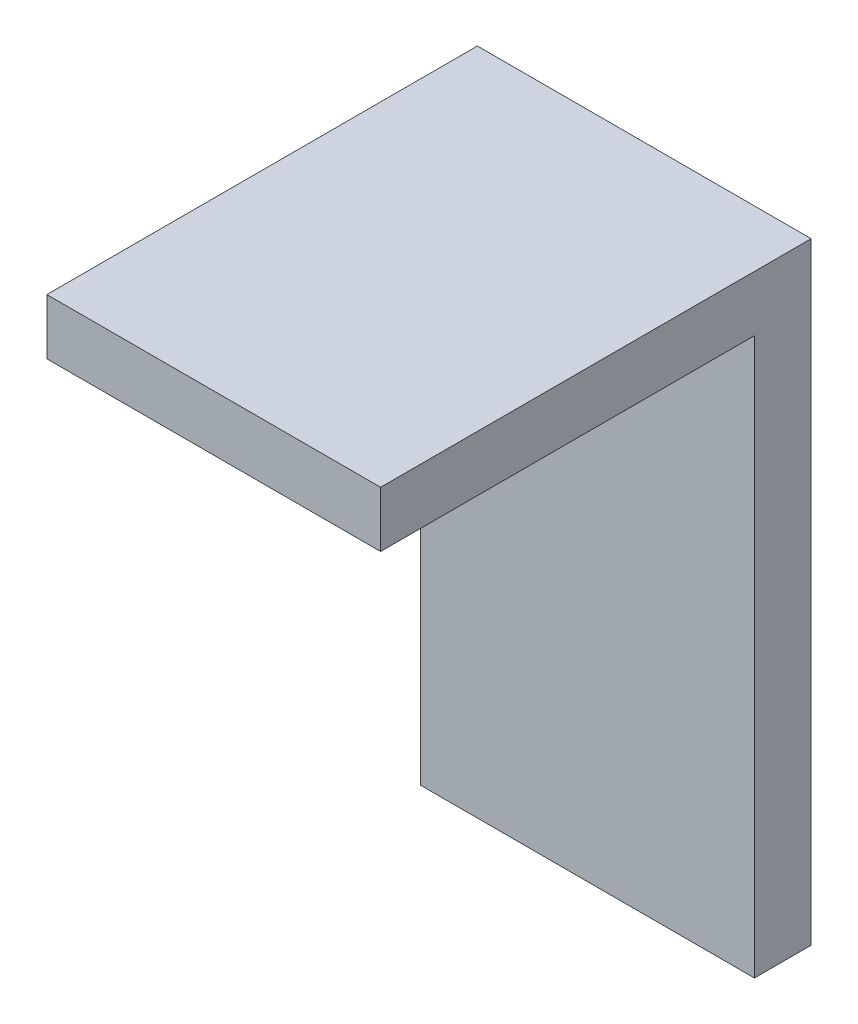
ISO-10303-21;
HEADER;
FILE_DESCRIPTION(('STEP AP214'),'2;1');
FILE_NAME('part.step','',(''),(''),'','','');
FILE_SCHEMA(('AUTOMOTIVE_DESIGN { 1 0 10303 214 1 1 1 1 }'));
ENDSEC;
DATA;
#1=APPLICATION_CONTEXT('core data for automotive mechanical design processes');
#2=APPLICATION_PROTOCOL_DEFINITION('international standard','automotive_design',2000,#1);
#3=PRODUCT_CONTEXT('',#1,'mechanical');
#4=PRODUCT('Part','Part','',(#3));
#5=PRODUCT_RELATED_PRODUCT_CATEGORY('part','',(#4));
#6=PRODUCT_DEFINITION_FORMATION('','',#4);
#7=PRODUCT_DEFINITION_CONTEXT('part definition',#1,'design');
#8=PRODUCT_DEFINITION('design','',#6,#7);
#9=PRODUCT_DEFINITION_SHAPE('','',#8);
#10=(LENGTH_UNIT() NAMED_UNIT(*) SI_UNIT(.MILLI.,.METRE.));
#11=(NAMED_UNIT(*) PLANE_ANGLE_UNIT() SI_UNIT($,.RADIAN.));
#12=(NAMED_UNIT(*) SI_UNIT($,.STERADIAN.) SOLID_ANGLE_UNIT());
#13=UNCERTAINTY_MEASURE_WITH_UNIT(LENGTH_MEASURE(1.E-05),#10,'distance_accuracy_value','');
#14=(GEOMETRIC_REPRESENTATION_CONTEXT(3) GLOBAL_UNCERTAINTY_ASSIGNED_CONTEXT((#13)) GLOBAL_UNIT_ASSIGNED_CONTEXT((#10,
#11,#12)) REPRESENTATION_CONTEXT('',''));
#15=CARTESIAN_POINT('',(0.,0.,0.));
#16=DIRECTION('',(0.,0.,1.));
#17=DIRECTION('',(1.,0.,0.));
#18=AXIS2_PLACEMENT_3D('',#15,#16,#17);
#19=CARTESIAN_POINT('',(1.1,4.55,0.));
#20=DIRECTION('',(-1.,0.,0.));
#21=DIRECTION('',(0.,0.,1.));
#22=AXIS2_PLACEMENT_3D('',#19,#20,#21);
#23=PLANE('',#22);
#24=DIRECTION('',(0.,1.,0.));
#25=VECTOR('',#24,1.);
#26=CARTESIAN_POINT('',(1.1,4.,0.));
#27=LINE('',#26,#25);
#28=CARTESIAN_POINT('',(1.1,4.,0.));
#29=VERTEX_POINT('',#28);
#30=CARTESIAN_POINT('',(1.1,4.55,0.));
#31=VERTEX_POINT('',#30);
#32=EDGE_CURVE('E11',#29,#31,#27,.T.);
#33=ORIENTED_EDGE('',*,*,#32,.F.);
#34=DIRECTION('',(0.,0.,-1.));
#35=VECTOR('',#34,1.);
#36=CARTESIAN_POINT('',(1.1,4.,0.051));
#37=LINE('',#36,#35);
#38=CARTESIAN_POINT('',(1.1,4.,0.051));
#39=VERTEX_POINT('',#38);
#40=EDGE_CURVE('E24',#39,#29,#37,.T.);
#41=ORIENTED_EDGE('',*,*,#40,.F.);
#42=DIRECTION('',(0.,-1.,0.));
#43=VECTOR('',#42,1.);
#44=CARTESIAN_POINT('',(1.1,4.5,0.051));
#45=LINE('',#44,#43);
#46=CARTESIAN_POINT('',(1.1,4.5,0.051));
#47=VERTEX_POINT('',#46);
#48=EDGE_CURVE('E87',#47,#39,#45,.T.);
#49=ORIENTED_EDGE('',*,*,#48,.F.);
#50=DIRECTION('',(0.,0.,-1.));
#51=VECTOR('',#50,1.);
#52=CARTESIAN_POINT('',(1.1,4.5,0.387));
#53=LINE('',#52,#51);
#54=CARTESIAN_POINT('',(1.1,4.5,0.387));
#55=VERTEX_POINT('',#54);
#56=EDGE_CURVE('E114',#55,#47,#53,.T.);
#57=ORIENTED_EDGE('',*,*,#56,.F.);
#58=DIRECTION('',(0.,-1.,0.));
#59=VECTOR('',#58,1.);
#60=CARTESIAN_POINT('',(1.1,4.55,0.387));
#61=LINE('',#60,#59);
#62=CARTESIAN_POINT('',(1.1,4.55,0.387));
#63=VERTEX_POINT('',#62);
#64=EDGE_CURVE('E111',#63,#55,#61,.T.);
#65=ORIENTED_EDGE('',*,*,#64,.F.);
#66=DIRECTION('',(0.,0.,1.));
#67=VECTOR('',#66,1.);
#68=CARTESIAN_POINT('',(1.1,4.55,0.));
#69=LINE('',#68,#67);
#70=EDGE_CURVE('E108',#31,#63,#69,.T.);
#71=ORIENTED_EDGE('',*,*,#70,.F.);
#72=EDGE_LOOP('',(#33,#41,#49,#57,#65,#71));
#73=FACE_BOUND('',#72,.T.);
#74=ADVANCED_FACE('F17',(#73),#23,.T.);
#75=CARTESIAN_POINT('',(1.4,4.,0.));
#76=DIRECTION('',(1.,0.,0.));
#77=DIRECTION('',(0.,0.,1.));
#78=AXIS2_PLACEMENT_3D('',#75,#76,#77);
#79=PLANE('',#78);
#80=DIRECTION('',(0.,-1.,0.));
#81=VECTOR('',#80,1.);
#82=CARTESIAN_POINT('',(1.4,4.55,0.));
#83=LINE('',#82,#81);
#84=CARTESIAN_POINT('',(1.4,4.55,0.));
#85=VERTEX_POINT('',#84);
#86=CARTESIAN_POINT('',(1.4,4.,0.));
#87=VERTEX_POINT('',#86);
#88=EDGE_CURVE('E106',#85,#87,#83,.T.);
#89=ORIENTED_EDGE('',*,*,#88,.F.);
#90=DIRECTION('',(0.,0.,-1.));
#91=VECTOR('',#90,1.);
#92=CARTESIAN_POINT('',(1.4,4.55,0.387));
#93=LINE('',#92,#91);
#94=CARTESIAN_POINT('',(1.4,4.55,0.387));
#95=VERTEX_POINT('',#94);
#96=EDGE_CURVE('E103',#95,#85,#93,.T.);
#97=ORIENTED_EDGE('',*,*,#96,.F.);
#98=DIRECTION('',(0.,1.,0.));
#99=VECTOR('',#98,1.);
#100=CARTESIAN_POINT('',(1.4,4.5,0.387));
#101=LINE('',#100,#99);
#102=CARTESIAN_POINT('',(1.4,4.5,0.387));
#103=VERTEX_POINT('',#102);
#104=EDGE_CURVE('E100',#103,#95,#101,.T.);
#105=ORIENTED_EDGE('',*,*,#104,.F.);
#106=DIRECTION('',(0.,0.,1.));
#107=VECTOR('',#106,1.);
#108=CARTESIAN_POINT('',(1.4,4.5,0.051));
#109=LINE('',#108,#107);
#110=CARTESIAN_POINT('',(1.4,4.5,0.051));
#111=VERTEX_POINT('',#110);
#112=EDGE_CURVE('E72',#111,#103,#109,.T.);
#113=ORIENTED_EDGE('',*,*,#112,.F.);
#114=DIRECTION('',(0.,1.,0.));
#115=VECTOR('',#114,1.);
#116=CARTESIAN_POINT('',(1.4,4.,0.051));
#117=LINE('',#116,#115);
#118=CARTESIAN_POINT('',(1.4,4.,0.051));
#119=VERTEX_POINT('',#118);
#120=EDGE_CURVE('E66',#119,#111,#117,.T.);
#121=ORIENTED_EDGE('',*,*,#120,.F.);
#122=DIRECTION('',(0.,0.,1.));
#123=VECTOR('',#122,1.);
#124=CARTESIAN_POINT('',(1.4,4.,0.));
#125=LINE('',#124,#123);
#126=EDGE_CURVE('E69',#87,#119,#125,.T.);
#127=ORIENTED_EDGE('',*,*,#126,.F.);
#128=EDGE_LOOP('',(#89,#97,#105,#113,#121,#127));
#129=FACE_BOUND('',#128,.T.);
#130=ADVANCED_FACE('F68',(#129),#79,.T.);
#131=CARTESIAN_POINT('',(1.1,4.55,0.387));
#132=DIRECTION('',(0.,0.,1.));
#133=DIRECTION('',(0.,1.,0.));
#134=AXIS2_PLACEMENT_3D('',#131,#132,#133);
#135=PLANE('',#134);
#136=ORIENTED_EDGE('',*,*,#64,.T.);
#137=DIRECTION('',(-1.,0.,0.));
#138=VECTOR('',#137,1.);
#139=CARTESIAN_POINT('',(1.4,4.5,0.387));
#140=LINE('',#139,#138);
#141=EDGE_CURVE('E83',#103,#55,#140,.T.);
#142=ORIENTED_EDGE('',*,*,#141,.F.);
#143=ORIENTED_EDGE('',*,*,#104,.T.);
#144=DIRECTION('',(1.,0.,0.));
#145=VECTOR('',#144,1.);
#146=CARTESIAN_POINT('',(1.1,4.55,0.387));
#147=LINE('',#146,#145);
#148=EDGE_CURVE('E88',#63,#95,#147,.T.);
#149=ORIENTED_EDGE('',*,*,#148,.F.);
#150=EDGE_LOOP('',(#136,#142,#143,#149));
#151=FACE_BOUND('',#150,.T.);
#152=ADVANCED_FACE('F125',(#151),#135,.T.);
#153=CARTESIAN_POINT('',(1.1,4.5,0.051));
#154=DIRECTION('',(0.,0.,1.));
#155=DIRECTION('',(0.,1.,0.));
#156=AXIS2_PLACEMENT_3D('',#153,#154,#155);
#157=PLANE('',#156);
#158=ORIENTED_EDGE('',*,*,#48,.T.);
#159=DIRECTION('',(-1.,0.,0.));
#160=VECTOR('',#159,1.);
#161=CARTESIAN_POINT('',(1.4,4.,0.051));
#162=LINE('',#161,#160);
#163=EDGE_CURVE('E81',#119,#39,#162,.T.);
#164=ORIENTED_EDGE('',*,*,#163,.F.);
#165=ORIENTED_EDGE('',*,*,#120,.T.);
#166=DIRECTION('',(1.,0.,0.));
#167=VECTOR('',#166,1.);
#168=CARTESIAN_POINT('',(1.1,4.5,0.051));
#169=LINE('',#168,#167);
#170=EDGE_CURVE('E89',#47,#111,#169,.T.);
#171=ORIENTED_EDGE('',*,*,#170,.F.);
#172=EDGE_LOOP('',(#158,#164,#165,#171));
#173=FACE_BOUND('',#172,.T.);
#174=ADVANCED_FACE('F86',(#173),#157,.T.);
#175=CARTESIAN_POINT('',(1.4,4.55,0.));
#176=DIRECTION('',(0.,1.,0.));
#177=DIRECTION('',(0.,0.,1.));
#178=AXIS2_PLACEMENT_3D('',#175,#176,#177);
#179=PLANE('',#178);
#180=DIRECTION('',(1.,0.,0.));
#181=VECTOR('',#180,1.);
#182=CARTESIAN_POINT('',(1.1,4.55,0.));
#183=LINE('',#182,#181);
#184=EDGE_CURVE('E93',#31,#85,#183,.T.);
#185=ORIENTED_EDGE('',*,*,#184,.F.);
#186=ORIENTED_EDGE('',*,*,#70,.T.);
#187=ORIENTED_EDGE('',*,*,#148,.T.);
#188=ORIENTED_EDGE('',*,*,#96,.T.);
#189=EDGE_LOOP('',(#185,#186,#187,#188));
#190=FACE_BOUND('',#189,.T.);
#191=ADVANCED_FACE('F121',(#190),#179,.T.);
#192=CARTESIAN_POINT('',(1.1,4.,0.));
#193=DIRECTION('',(0.,-1.,0.));
#194=DIRECTION('',(0.,0.,1.));
#195=AXIS2_PLACEMENT_3D('',#192,#193,#194);
#196=PLANE('',#195);
#197=DIRECTION('',(-1.,0.,0.));
#198=VECTOR('',#197,1.);
#199=CARTESIAN_POINT('',(1.4,4.,0.));
#200=LINE('',#199,#198);
#201=EDGE_CURVE('E82',#87,#29,#200,.T.);
#202=ORIENTED_EDGE('',*,*,#201,.F.);
#203=ORIENTED_EDGE('',*,*,#126,.T.);
#204=ORIENTED_EDGE('',*,*,#163,.T.);
#205=ORIENTED_EDGE('',*,*,#40,.T.);
#206=EDGE_LOOP('',(#202,#203,#204,#205));
#207=FACE_BOUND('',#206,.T.);
#208=ADVANCED_FACE('F80',(#207),#196,.T.);
#209=CARTESIAN_POINT('',(1.1,4.5,0.051));
#210=DIRECTION('',(0.,-1.,0.));
#211=DIRECTION('',(0.,0.,1.));
#212=AXIS2_PLACEMENT_3D('',#209,#210,#211);
#213=PLANE('',#212);
#214=ORIENTED_EDGE('',*,*,#170,.T.);
#215=ORIENTED_EDGE('',*,*,#112,.T.);
#216=ORIENTED_EDGE('',*,*,#141,.T.);
#217=ORIENTED_EDGE('',*,*,#56,.T.);
#218=EDGE_LOOP('',(#214,#215,#216,#217));
#219=FACE_BOUND('',#218,.T.);
#220=ADVANCED_FACE('F127',(#219),#213,.T.);
#221=CARTESIAN_POINT('',(1.4,4.55,0.));
#222=DIRECTION('',(0.,0.,-1.));
#223=DIRECTION('',(0.,1.,0.));
#224=AXIS2_PLACEMENT_3D('',#221,#222,#223);
#225=PLANE('',#224);
#226=ORIENTED_EDGE('',*,*,#88,.T.);
#227=ORIENTED_EDGE('',*,*,#201,.T.);
#228=ORIENTED_EDGE('',*,*,#32,.T.);
#229=ORIENTED_EDGE('',*,*,#184,.T.);
#230=EDGE_LOOP('',(#226,#227,#228,#229));
#231=FACE_BOUND('',#230,.T.);
#232=ADVANCED_FACE('F117',(#231),#225,.T.);
#233=CLOSED_SHELL('',(#74,#130,#152,#174,#191,#208,#220,#232));
#234=MANIFOLD_SOLID_BREP('B1',#233);
#235=ADVANCED_BREP_SHAPE_REPRESENTATION('',(#18,#234),#14);
#236=SHAPE_DEFINITION_REPRESENTATION(#9,#235);
ENDSEC;
END-ISO-10303-21;
